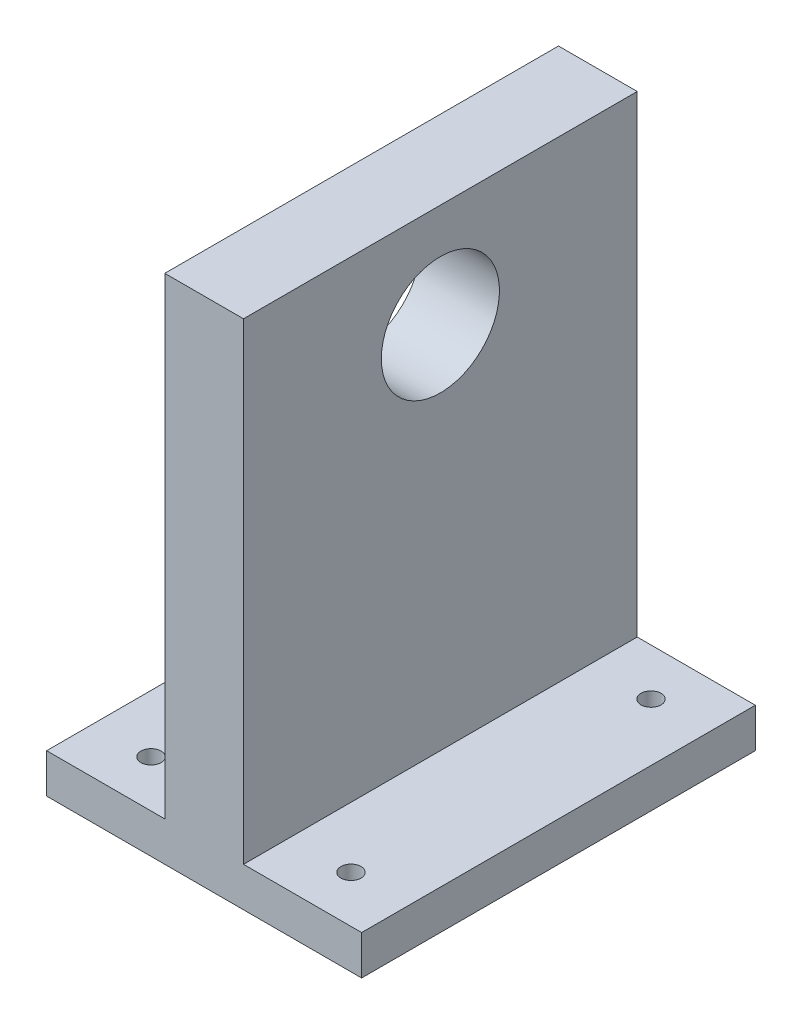
ISO-10303-21;
HEADER;
FILE_DESCRIPTION(('STEP AP214'),'2;1');
FILE_NAME('part.step','',(''),(''),'','','');
FILE_SCHEMA(('AUTOMOTIVE_DESIGN { 1 0 10303 214 1 1 1 1 }'));
ENDSEC;
DATA;
#1=APPLICATION_CONTEXT('core data for automotive mechanical design processes');
#2=APPLICATION_PROTOCOL_DEFINITION('international standard','automotive_design',2000,#1);
#3=PRODUCT_CONTEXT('',#1,'mechanical');
#4=PRODUCT('Part','Part','',(#3));
#5=PRODUCT_RELATED_PRODUCT_CATEGORY('part','',(#4));
#6=PRODUCT_DEFINITION_FORMATION('','',#4);
#7=PRODUCT_DEFINITION_CONTEXT('part definition',#1,'design');
#8=PRODUCT_DEFINITION('design','',#6,#7);
#9=PRODUCT_DEFINITION_SHAPE('','',#8);
#10=(LENGTH_UNIT() NAMED_UNIT(*) SI_UNIT(.MILLI.,.METRE.));
#11=(NAMED_UNIT(*) PLANE_ANGLE_UNIT() SI_UNIT($,.RADIAN.));
#12=(NAMED_UNIT(*) SI_UNIT($,.STERADIAN.) SOLID_ANGLE_UNIT());
#13=UNCERTAINTY_MEASURE_WITH_UNIT(LENGTH_MEASURE(1.E-05),#10,'distance_accuracy_value','');
#14=(GEOMETRIC_REPRESENTATION_CONTEXT(3) GLOBAL_UNCERTAINTY_ASSIGNED_CONTEXT((#13)) GLOBAL_UNIT_ASSIGNED_CONTEXT((#10,
#11,#12)) REPRESENTATION_CONTEXT('',''));
#15=CARTESIAN_POINT('',(0.,0.,0.));
#16=DIRECTION('',(0.,0.,1.));
#17=DIRECTION('',(1.,0.,0.));
#18=AXIS2_PLACEMENT_3D('',#15,#16,#17);
#19=CARTESIAN_POINT('',(0.,10.,0.));
#20=DIRECTION('',(0.,1.,0.));
#21=DIRECTION('',(0.,0.,1.));
#22=AXIS2_PLACEMENT_3D('',#19,#20,#21);
#23=PLANE('',#22);
#24=CARTESIAN_POINT('',(25.4,10.,-38.1));
#25=DIRECTION('',(0.,1.,0.));
#26=DIRECTION('',(0.,0.,1.));
#27=AXIS2_PLACEMENT_3D('',#24,#25,#26);
#28=CIRCLE('',#27,2.555);
#29=CARTESIAN_POINT('',(25.4,10.,-35.545));
#30=VERTEX_POINT('',#29);
#31=EDGE_CURVE('E218',#30,#30,#28,.F.);
#32=ORIENTED_EDGE('',*,*,#31,.T.);
#33=EDGE_LOOP('',(#32));
#34=FACE_BOUND('',#33,.T.);
#35=DIRECTION('',(0.,0.,-1.));
#36=VECTOR('',#35,1.);
#37=CARTESIAN_POINT('',(10.,10.,50.));
#38=LINE('',#37,#36);
#39=CARTESIAN_POINT('',(10.,10.,50.));
#40=VERTEX_POINT('',#39);
#41=CARTESIAN_POINT('',(10.,10.,-50.));
#42=VERTEX_POINT('',#41);
#43=EDGE_CURVE('E136',#40,#42,#38,.T.);
#44=ORIENTED_EDGE('',*,*,#43,.F.);
#45=DIRECTION('',(1.,0.,0.));
#46=VECTOR('',#45,1.);
#47=CARTESIAN_POINT('',(-40.,10.,50.));
#48=LINE('',#47,#46);
#49=CARTESIAN_POINT('',(40.,10.,50.));
#50=VERTEX_POINT('',#49);
#51=EDGE_CURVE('E153',#40,#50,#48,.T.);
#52=ORIENTED_EDGE('',*,*,#51,.T.);
#53=DIRECTION('',(0.,0.,-1.));
#54=VECTOR('',#53,1.);
#55=CARTESIAN_POINT('',(40.,10.,50.));
#56=LINE('',#55,#54);
#57=CARTESIAN_POINT('',(40.,10.,-50.));
#58=VERTEX_POINT('',#57);
#59=EDGE_CURVE('E152',#50,#58,#56,.T.);
#60=ORIENTED_EDGE('',*,*,#59,.T.);
#61=DIRECTION('',(1.,0.,0.));
#62=VECTOR('',#61,1.);
#63=CARTESIAN_POINT('',(-40.,10.,-50.));
#64=LINE('',#63,#62);
#65=EDGE_CURVE('E61',#42,#58,#64,.T.);
#66=ORIENTED_EDGE('',*,*,#65,.F.);
#67=EDGE_LOOP('',(#44,#52,#60,#66));
#68=FACE_BOUND('',#67,.T.);
#69=CARTESIAN_POINT('',(25.4,10.,38.1));
#70=DIRECTION('',(0.,1.,0.));
#71=DIRECTION('',(0.,0.,1.));
#72=AXIS2_PLACEMENT_3D('',#69,#70,#71);
#73=CIRCLE('',#72,2.555);
#74=CARTESIAN_POINT('',(25.4,10.,40.655));
#75=VERTEX_POINT('',#74);
#76=EDGE_CURVE('E210',#75,#75,#73,.T.);
#77=ORIENTED_EDGE('',*,*,#76,.F.);
#78=EDGE_LOOP('',(#77));
#79=FACE_BOUND('',#78,.T.);
#80=ADVANCED_FACE('F45',(#34,#68,#79),#23,.T.);
#81=CARTESIAN_POINT('',(-25.4,10.,38.1));
#82=DIRECTION('',(0.,1.,0.));
#83=DIRECTION('',(0.,0.,1.));
#84=AXIS2_PLACEMENT_3D('',#81,#82,#83);
#85=CIRCLE('',#84,2.555);
#86=CARTESIAN_POINT('',(-25.4,10.,40.655));
#87=VERTEX_POINT('',#86);
#88=EDGE_CURVE('E226',#87,#87,#85,.F.);
#89=ORIENTED_EDGE('',*,*,#88,.T.);
#90=EDGE_LOOP('',(#89));
#91=FACE_BOUND('',#90,.T.);
#92=DIRECTION('',(0.,0.,1.));
#93=VECTOR('',#92,1.);
#94=CARTESIAN_POINT('',(-10.,10.,50.));
#95=LINE('',#94,#93);
#96=CARTESIAN_POINT('',(-10.,10.,-50.));
#97=VERTEX_POINT('',#96);
#98=CARTESIAN_POINT('',(-10.,10.,50.));
#99=VERTEX_POINT('',#98);
#100=EDGE_CURVE('E69',#97,#99,#95,.T.);
#101=ORIENTED_EDGE('',*,*,#100,.F.);
#102=CARTESIAN_POINT('',(-40.,10.,-50.));
#103=VERTEX_POINT('',#102);
#104=EDGE_CURVE('E156',#103,#97,#64,.T.);
#105=ORIENTED_EDGE('',*,*,#104,.F.);
#106=DIRECTION('',(0.,0.,-1.));
#107=VECTOR('',#106,1.);
#108=CARTESIAN_POINT('',(-40.,10.,50.));
#109=LINE('',#108,#107);
#110=CARTESIAN_POINT('',(-40.,10.,50.));
#111=VERTEX_POINT('',#110);
#112=EDGE_CURVE('E159',#111,#103,#109,.T.);
#113=ORIENTED_EDGE('',*,*,#112,.F.);
#114=EDGE_CURVE('E149',#111,#99,#48,.T.);
#115=ORIENTED_EDGE('',*,*,#114,.T.);
#116=EDGE_LOOP('',(#101,#105,#113,#115));
#117=FACE_BOUND('',#116,.T.);
#118=CARTESIAN_POINT('',(-25.4,10.,-38.1));
#119=DIRECTION('',(0.,1.,0.));
#120=DIRECTION('',(0.,0.,1.));
#121=AXIS2_PLACEMENT_3D('',#118,#119,#120);
#122=CIRCLE('',#121,2.555);
#123=CARTESIAN_POINT('',(-25.4,10.,-35.545));
#124=VERTEX_POINT('',#123);
#125=EDGE_CURVE('E222',#124,#124,#122,.T.);
#126=ORIENTED_EDGE('',*,*,#125,.F.);
#127=EDGE_LOOP('',(#126));
#128=FACE_BOUND('',#127,.T.);
#129=ADVANCED_FACE('F194',(#91,#117,#128),#23,.T.);
#130=CARTESIAN_POINT('',(0.,0.,0.));
#131=DIRECTION('',(0.,1.,0.));
#132=DIRECTION('',(0.,0.,1.));
#133=AXIS2_PLACEMENT_3D('',#130,#131,#132);
#134=PLANE('',#133);
#135=CARTESIAN_POINT('',(-25.4,0.,-38.1));
#136=DIRECTION('',(0.,-1.,0.));
#137=DIRECTION('',(0.,0.,-1.));
#138=AXIS2_PLACEMENT_3D('',#135,#136,#137);
#139=CIRCLE('',#138,2.555);
#140=CARTESIAN_POINT('',(-25.4,0.,-40.655));
#141=VERTEX_POINT('',#140);
#142=EDGE_CURVE('E234',#141,#141,#139,.T.);
#143=ORIENTED_EDGE('',*,*,#142,.F.);
#144=EDGE_LOOP('',(#143));
#145=FACE_BOUND('',#144,.T.);
#146=CARTESIAN_POINT('',(-25.4,0.,38.1));
#147=DIRECTION('',(0.,1.,0.));
#148=DIRECTION('',(0.,0.,1.));
#149=AXIS2_PLACEMENT_3D('',#146,#147,#148);
#150=CIRCLE('',#149,2.555);
#151=CARTESIAN_POINT('',(-25.4,0.,40.655));
#152=VERTEX_POINT('',#151);
#153=EDGE_CURVE('E230',#152,#152,#150,.T.);
#154=ORIENTED_EDGE('',*,*,#153,.T.);
#155=EDGE_LOOP('',(#154));
#156=FACE_BOUND('',#155,.T.);
#157=DIRECTION('',(1.,0.,0.));
#158=VECTOR('',#157,1.);
#159=CARTESIAN_POINT('',(-40.,0.,50.));
#160=LINE('',#159,#158);
#161=CARTESIAN_POINT('',(-40.,0.,50.));
#162=VERTEX_POINT('',#161);
#163=CARTESIAN_POINT('',(40.,0.,50.));
#164=VERTEX_POINT('',#163);
#165=EDGE_CURVE('E138',#162,#164,#160,.T.);
#166=ORIENTED_EDGE('',*,*,#165,.F.);
#167=DIRECTION('',(0.,0.,-1.));
#168=VECTOR('',#167,1.);
#169=CARTESIAN_POINT('',(-40.,0.,50.));
#170=LINE('',#169,#168);
#171=CARTESIAN_POINT('',(-40.,0.,-50.));
#172=VERTEX_POINT('',#171);
#173=EDGE_CURVE('E171',#162,#172,#170,.T.);
#174=ORIENTED_EDGE('',*,*,#173,.T.);
#175=DIRECTION('',(1.,0.,0.));
#176=VECTOR('',#175,1.);
#177=CARTESIAN_POINT('',(-40.,0.,-50.));
#178=LINE('',#177,#176);
#179=CARTESIAN_POINT('',(40.,0.,-50.));
#180=VERTEX_POINT('',#179);
#181=EDGE_CURVE('E167',#172,#180,#178,.T.);
#182=ORIENTED_EDGE('',*,*,#181,.T.);
#183=DIRECTION('',(0.,0.,-1.));
#184=VECTOR('',#183,1.);
#185=CARTESIAN_POINT('',(40.,0.,50.));
#186=LINE('',#185,#184);
#187=EDGE_CURVE('E143',#164,#180,#186,.T.);
#188=ORIENTED_EDGE('',*,*,#187,.F.);
#189=EDGE_LOOP('',(#166,#174,#182,#188));
#190=FACE_BOUND('',#189,.T.);
#191=CARTESIAN_POINT('',(25.4,0.,-38.1));
#192=DIRECTION('',(0.,1.,0.));
#193=DIRECTION('',(0.,0.,1.));
#194=AXIS2_PLACEMENT_3D('',#191,#192,#193);
#195=CIRCLE('',#194,2.555);
#196=CARTESIAN_POINT('',(25.4,0.,-35.545));
#197=VERTEX_POINT('',#196);
#198=EDGE_CURVE('E239',#197,#197,#195,.T.);
#199=ORIENTED_EDGE('',*,*,#198,.T.);
#200=EDGE_LOOP('',(#199));
#201=FACE_BOUND('',#200,.T.);
#202=CARTESIAN_POINT('',(25.4,0.,38.1));
#203=DIRECTION('',(0.,-1.,0.));
#204=DIRECTION('',(0.,0.,-1.));
#205=AXIS2_PLACEMENT_3D('',#202,#203,#204);
#206=CIRCLE('',#205,2.555);
#207=CARTESIAN_POINT('',(25.4,0.,35.545));
#208=VERTEX_POINT('',#207);
#209=EDGE_CURVE('E235',#208,#208,#206,.T.);
#210=ORIENTED_EDGE('',*,*,#209,.F.);
#211=EDGE_LOOP('',(#210));
#212=FACE_BOUND('',#211,.T.);
#213=ADVANCED_FACE('F187',(#145,#156,#190,#201,#212),#134,.F.);
#214=CARTESIAN_POINT('',(-40.,10.,50.));
#215=DIRECTION('',(0.,0.,-1.));
#216=DIRECTION('',(-1.,0.,0.));
#217=AXIS2_PLACEMENT_3D('',#214,#215,#216);
#218=PLANE('',#217);
#219=ORIENTED_EDGE('',*,*,#165,.T.);
#220=DIRECTION('',(0.,-1.,0.));
#221=VECTOR('',#220,1.);
#222=CARTESIAN_POINT('',(40.,10.,50.));
#223=LINE('',#222,#221);
#224=EDGE_CURVE('E11',#50,#164,#223,.T.);
#225=ORIENTED_EDGE('',*,*,#224,.F.);
#226=ORIENTED_EDGE('',*,*,#51,.F.);
#227=DIRECTION('',(0.,-1.,0.));
#228=VECTOR('',#227,1.);
#229=CARTESIAN_POINT('',(10.,130.,50.));
#230=LINE('',#229,#228);
#231=CARTESIAN_POINT('',(10.,130.,50.));
#232=VERTEX_POINT('',#231);
#233=EDGE_CURVE('E204',#232,#40,#230,.T.);
#234=ORIENTED_EDGE('',*,*,#233,.F.);
#235=DIRECTION('',(1.,0.,0.));
#236=VECTOR('',#235,1.);
#237=CARTESIAN_POINT('',(-10.,130.,50.));
#238=LINE('',#237,#236);
#239=CARTESIAN_POINT('',(-10.,130.,50.));
#240=VERTEX_POINT('',#239);
#241=EDGE_CURVE('E129',#240,#232,#238,.T.);
#242=ORIENTED_EDGE('',*,*,#241,.F.);
#243=DIRECTION('',(0.,-1.,0.));
#244=VECTOR('',#243,1.);
#245=CARTESIAN_POINT('',(-10.,130.,50.));
#246=LINE('',#245,#244);
#247=EDGE_CURVE('E145',#240,#99,#246,.T.);
#248=ORIENTED_EDGE('',*,*,#247,.T.);
#249=ORIENTED_EDGE('',*,*,#114,.F.);
#250=DIRECTION('',(0.,-1.,0.));
#251=VECTOR('',#250,1.);
#252=CARTESIAN_POINT('',(-40.,10.,50.));
#253=LINE('',#252,#251);
#254=EDGE_CURVE('E162',#111,#162,#253,.T.);
#255=ORIENTED_EDGE('',*,*,#254,.T.);
#256=EDGE_LOOP('',(#219,#225,#226,#234,#242,#248,#249,#255));
#257=FACE_BOUND('',#256,.T.);
#258=ADVANCED_FACE('F47',(#257),#218,.F.);
#259=CARTESIAN_POINT('',(40.,10.,50.));
#260=DIRECTION('',(-1.,0.,0.));
#261=DIRECTION('',(0.,0.,1.));
#262=AXIS2_PLACEMENT_3D('',#259,#260,#261);
#263=PLANE('',#262);
#264=ORIENTED_EDGE('',*,*,#187,.T.);
#265=DIRECTION('',(0.,-1.,0.));
#266=VECTOR('',#265,1.);
#267=CARTESIAN_POINT('',(40.,10.,-50.));
#268=LINE('',#267,#266);
#269=EDGE_CURVE('E54',#58,#180,#268,.T.);
#270=ORIENTED_EDGE('',*,*,#269,.F.);
#271=ORIENTED_EDGE('',*,*,#59,.F.);
#272=ORIENTED_EDGE('',*,*,#224,.T.);
#273=EDGE_LOOP('',(#264,#270,#271,#272));
#274=FACE_BOUND('',#273,.T.);
#275=ADVANCED_FACE('F183',(#274),#263,.F.);
#276=CARTESIAN_POINT('',(-40.,10.,-50.));
#277=DIRECTION('',(0.,0.,-1.));
#278=DIRECTION('',(-1.,0.,0.));
#279=AXIS2_PLACEMENT_3D('',#276,#277,#278);
#280=PLANE('',#279);
#281=ORIENTED_EDGE('',*,*,#181,.F.);
#282=DIRECTION('',(0.,-1.,0.));
#283=VECTOR('',#282,1.);
#284=CARTESIAN_POINT('',(-40.,10.,-50.));
#285=LINE('',#284,#283);
#286=EDGE_CURVE('E177',#103,#172,#285,.T.);
#287=ORIENTED_EDGE('',*,*,#286,.F.);
#288=ORIENTED_EDGE('',*,*,#104,.T.);
#289=DIRECTION('',(0.,-1.,0.));
#290=VECTOR('',#289,1.);
#291=CARTESIAN_POINT('',(-10.,130.,-50.));
#292=LINE('',#291,#290);
#293=CARTESIAN_POINT('',(-10.,130.,-50.));
#294=VERTEX_POINT('',#293);
#295=EDGE_CURVE('E119',#294,#97,#292,.T.);
#296=ORIENTED_EDGE('',*,*,#295,.F.);
#297=DIRECTION('',(-1.,0.,0.));
#298=VECTOR('',#297,1.);
#299=CARTESIAN_POINT('',(-10.,130.,-50.));
#300=LINE('',#299,#298);
#301=CARTESIAN_POINT('',(10.,130.,-50.));
#302=VERTEX_POINT('',#301);
#303=EDGE_CURVE('E111',#302,#294,#300,.T.);
#304=ORIENTED_EDGE('',*,*,#303,.F.);
#305=DIRECTION('',(0.,-1.,0.));
#306=VECTOR('',#305,1.);
#307=CARTESIAN_POINT('',(10.,130.,-50.));
#308=LINE('',#307,#306);
#309=EDGE_CURVE('E116',#302,#42,#308,.T.);
#310=ORIENTED_EDGE('',*,*,#309,.T.);
#311=ORIENTED_EDGE('',*,*,#65,.T.);
#312=ORIENTED_EDGE('',*,*,#269,.T.);
#313=EDGE_LOOP('',(#281,#287,#288,#296,#304,#310,#311,#312));
#314=FACE_BOUND('',#313,.T.);
#315=ADVANCED_FACE('F114',(#314),#280,.T.);
#316=CARTESIAN_POINT('',(-40.,10.,50.));
#317=DIRECTION('',(-1.,0.,0.));
#318=DIRECTION('',(0.,0.,1.));
#319=AXIS2_PLACEMENT_3D('',#316,#317,#318);
#320=PLANE('',#319);
#321=ORIENTED_EDGE('',*,*,#173,.F.);
#322=ORIENTED_EDGE('',*,*,#254,.F.);
#323=ORIENTED_EDGE('',*,*,#112,.T.);
#324=ORIENTED_EDGE('',*,*,#286,.T.);
#325=EDGE_LOOP('',(#321,#322,#323,#324));
#326=FACE_BOUND('',#325,.T.);
#327=ADVANCED_FACE('F191',(#326),#320,.T.);
#328=CARTESIAN_POINT('',(10.,130.,50.));
#329=DIRECTION('',(-1.,0.,0.));
#330=DIRECTION('',(0.,0.,1.));
#331=AXIS2_PLACEMENT_3D('',#328,#329,#330);
#332=PLANE('',#331);
#333=CARTESIAN_POINT('',(10.,103.69,0.));
#334=DIRECTION('',(-1.,0.,0.));
#335=DIRECTION('',(0.,0.,1.));
#336=AXIS2_PLACEMENT_3D('',#333,#334,#335);
#337=CIRCLE('',#336,15.);
#338=CARTESIAN_POINT('',(10.,103.69,15.));
#339=VERTEX_POINT('',#338);
#340=EDGE_CURVE('E240',#339,#339,#337,.T.);
#341=ORIENTED_EDGE('',*,*,#340,.T.);
#342=EDGE_LOOP('',(#341));
#343=FACE_BOUND('',#342,.T.);
#344=ORIENTED_EDGE('',*,*,#43,.T.);
#345=ORIENTED_EDGE('',*,*,#309,.F.);
#346=DIRECTION('',(0.,0.,-1.));
#347=VECTOR('',#346,1.);
#348=CARTESIAN_POINT('',(10.,130.,50.));
#349=LINE('',#348,#347);
#350=EDGE_CURVE('E124',#232,#302,#349,.T.);
#351=ORIENTED_EDGE('',*,*,#350,.F.);
#352=ORIENTED_EDGE('',*,*,#233,.T.);
#353=EDGE_LOOP('',(#344,#345,#351,#352));
#354=FACE_BOUND('',#353,.T.);
#355=ADVANCED_FACE('F135',(#343,#354),#332,.F.);
#356=CARTESIAN_POINT('',(-10.,130.,50.));
#357=DIRECTION('',(1.,0.,0.));
#358=DIRECTION('',(0.,0.,-1.));
#359=AXIS2_PLACEMENT_3D('',#356,#357,#358);
#360=PLANE('',#359);
#361=CARTESIAN_POINT('',(-10.,103.69,0.));
#362=DIRECTION('',(-1.,0.,0.));
#363=DIRECTION('',(0.,0.,1.));
#364=AXIS2_PLACEMENT_3D('',#361,#362,#363);
#365=CIRCLE('',#364,15.);
#366=CARTESIAN_POINT('',(-10.,103.69,15.));
#367=VERTEX_POINT('',#366);
#368=EDGE_CURVE('E250',#367,#367,#365,.T.);
#369=ORIENTED_EDGE('',*,*,#368,.F.);
#370=EDGE_LOOP('',(#369));
#371=FACE_BOUND('',#370,.T.);
#372=ORIENTED_EDGE('',*,*,#100,.T.);
#373=ORIENTED_EDGE('',*,*,#247,.F.);
#374=DIRECTION('',(0.,0.,1.));
#375=VECTOR('',#374,1.);
#376=CARTESIAN_POINT('',(-10.,130.,50.));
#377=LINE('',#376,#375);
#378=EDGE_CURVE('E123',#294,#240,#377,.T.);
#379=ORIENTED_EDGE('',*,*,#378,.F.);
#380=ORIENTED_EDGE('',*,*,#295,.T.);
#381=EDGE_LOOP('',(#372,#373,#379,#380));
#382=FACE_BOUND('',#381,.T.);
#383=ADVANCED_FACE('F200',(#371,#382),#360,.F.);
#384=CARTESIAN_POINT('',(0.,130.,0.));
#385=DIRECTION('',(0.,-1.,0.));
#386=DIRECTION('',(0.,0.,-1.));
#387=AXIS2_PLACEMENT_3D('',#384,#385,#386);
#388=PLANE('',#387);
#389=ORIENTED_EDGE('',*,*,#350,.T.);
#390=ORIENTED_EDGE('',*,*,#303,.T.);
#391=ORIENTED_EDGE('',*,*,#378,.T.);
#392=ORIENTED_EDGE('',*,*,#241,.T.);
#393=EDGE_LOOP('',(#389,#390,#391,#392));
#394=FACE_BOUND('',#393,.T.);
#395=ADVANCED_FACE('F127',(#394),#388,.F.);
#396=CARTESIAN_POINT('',(-25.4,55.,38.1));
#397=DIRECTION('',(0.,-1.,0.));
#398=DIRECTION('',(0.,0.,-1.));
#399=AXIS2_PLACEMENT_3D('',#396,#397,#398);
#400=CYLINDRICAL_SURFACE('',#399,2.555);
#401=ORIENTED_EDGE('',*,*,#88,.F.);
#402=EDGE_LOOP('',(#401));
#403=FACE_BOUND('',#402,.T.);
#404=ORIENTED_EDGE('',*,*,#153,.F.);
#405=EDGE_LOOP('',(#404));
#406=FACE_BOUND('',#405,.T.);
#407=ADVANCED_FACE('F265',(#403,#406),#400,.F.);
#408=CARTESIAN_POINT('',(-25.4,55.,-38.1));
#409=DIRECTION('',(0.,-1.,0.));
#410=DIRECTION('',(0.,0.,-1.));
#411=AXIS2_PLACEMENT_3D('',#408,#409,#410);
#412=CYLINDRICAL_SURFACE('',#411,2.555);
#413=ORIENTED_EDGE('',*,*,#125,.T.);
#414=EDGE_LOOP('',(#413));
#415=FACE_BOUND('',#414,.T.);
#416=ORIENTED_EDGE('',*,*,#142,.T.);
#417=EDGE_LOOP('',(#416));
#418=FACE_BOUND('',#417,.T.);
#419=ADVANCED_FACE('F330',(#415,#418),#412,.F.);
#420=CARTESIAN_POINT('',(25.4,55.,-38.1));
#421=DIRECTION('',(0.,-1.,0.));
#422=DIRECTION('',(0.,0.,-1.));
#423=AXIS2_PLACEMENT_3D('',#420,#421,#422);
#424=CYLINDRICAL_SURFACE('',#423,2.555);
#425=ORIENTED_EDGE('',*,*,#31,.F.);
#426=EDGE_LOOP('',(#425));
#427=FACE_BOUND('',#426,.T.);
#428=ORIENTED_EDGE('',*,*,#198,.F.);
#429=EDGE_LOOP('',(#428));
#430=FACE_BOUND('',#429,.T.);
#431=ADVANCED_FACE('F340',(#427,#430),#424,.F.);
#432=CARTESIAN_POINT('',(25.4,55.,38.1));
#433=DIRECTION('',(0.,-1.,0.));
#434=DIRECTION('',(0.,0.,-1.));
#435=AXIS2_PLACEMENT_3D('',#432,#433,#434);
#436=CYLINDRICAL_SURFACE('',#435,2.555);
#437=ORIENTED_EDGE('',*,*,#76,.T.);
#438=EDGE_LOOP('',(#437));
#439=FACE_BOUND('',#438,.T.);
#440=ORIENTED_EDGE('',*,*,#209,.T.);
#441=EDGE_LOOP('',(#440));
#442=FACE_BOUND('',#441,.T.);
#443=ADVANCED_FACE('F350',(#439,#442),#436,.F.);
#444=CARTESIAN_POINT('',(19.,103.69,0.));
#445=DIRECTION('',(-1.,0.,0.));
#446=DIRECTION('',(0.,0.,1.));
#447=AXIS2_PLACEMENT_3D('',#444,#445,#446);
#448=CYLINDRICAL_SURFACE('',#447,15.);
#449=ORIENTED_EDGE('',*,*,#368,.T.);
#450=EDGE_LOOP('',(#449));
#451=FACE_BOUND('',#450,.T.);
#452=ORIENTED_EDGE('',*,*,#340,.F.);
#453=EDGE_LOOP('',(#452));
#454=FACE_BOUND('',#453,.T.);
#455=ADVANCED_FACE('F255',(#451,#454),#448,.F.);
#456=CLOSED_SHELL('',(#80,#129,#213,#258,#275,#315,#327,#355,#383,#395,#407,#419,#431,#443,#455));
#457=MANIFOLD_SOLID_BREP('B2',#456);
#458=ADVANCED_BREP_SHAPE_REPRESENTATION('',(#18,#457),#14);
#459=SHAPE_DEFINITION_REPRESENTATION(#9,#458);
ENDSEC;
END-ISO-10303-21;
